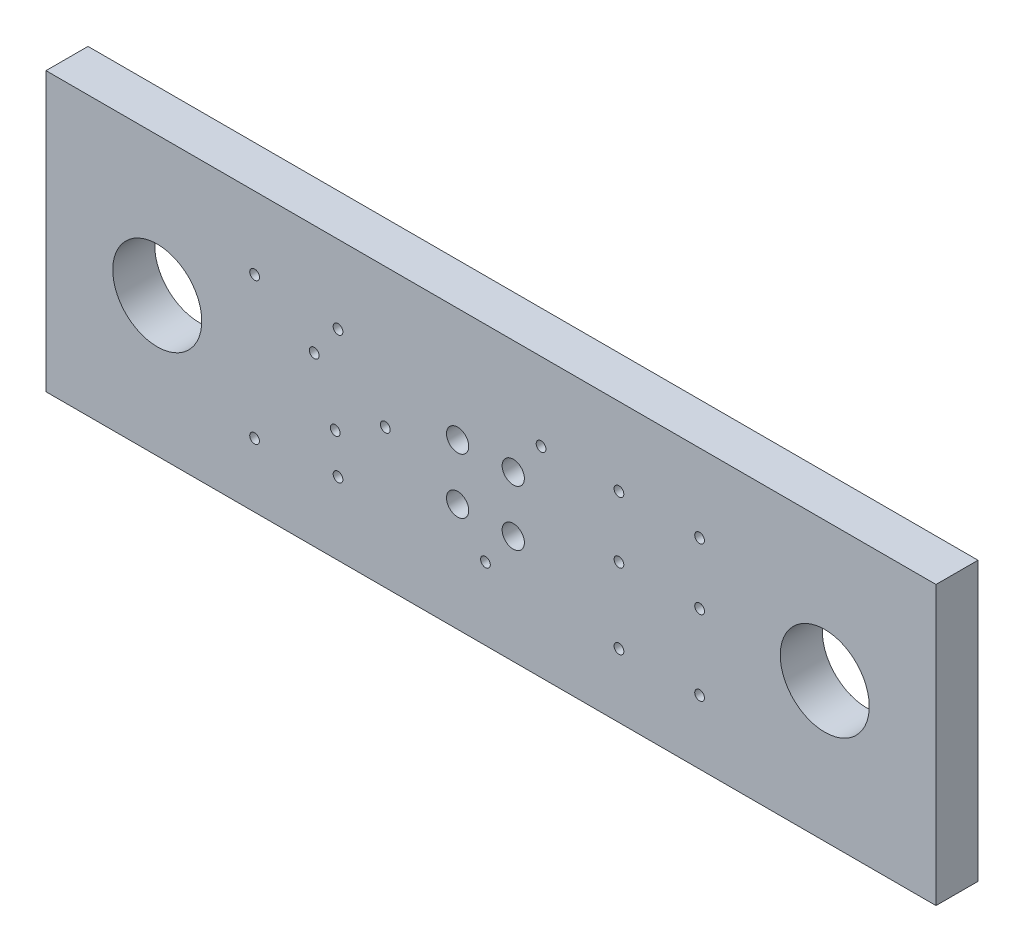
ISO-10303-21;
HEADER;
FILE_DESCRIPTION(('STEP AP214'),'2;1');
FILE_NAME('part.step','',(''),(''),'','','');
FILE_SCHEMA(('AUTOMOTIVE_DESIGN { 1 0 10303 214 1 1 1 1 }'));
ENDSEC;
DATA;
#1=APPLICATION_CONTEXT('core data for automotive mechanical design processes');
#2=APPLICATION_PROTOCOL_DEFINITION('international standard','automotive_design',2000,#1);
#3=PRODUCT_CONTEXT('',#1,'mechanical');
#4=PRODUCT('Part','Part','',(#3));
#5=PRODUCT_RELATED_PRODUCT_CATEGORY('part','',(#4));
#6=PRODUCT_DEFINITION_FORMATION('','',#4);
#7=PRODUCT_DEFINITION_CONTEXT('part definition',#1,'design');
#8=PRODUCT_DEFINITION('design','',#6,#7);
#9=PRODUCT_DEFINITION_SHAPE('','',#8);
#10=(LENGTH_UNIT() NAMED_UNIT(*) SI_UNIT(.MILLI.,.METRE.));
#11=(NAMED_UNIT(*) PLANE_ANGLE_UNIT() SI_UNIT($,.RADIAN.));
#12=(NAMED_UNIT(*) SI_UNIT($,.STERADIAN.) SOLID_ANGLE_UNIT());
#13=UNCERTAINTY_MEASURE_WITH_UNIT(LENGTH_MEASURE(1.E-05),#10,'distance_accuracy_value','');
#14=(GEOMETRIC_REPRESENTATION_CONTEXT(3) GLOBAL_UNCERTAINTY_ASSIGNED_CONTEXT((#13)) GLOBAL_UNIT_ASSIGNED_CONTEXT((#10,
#11,#12)) REPRESENTATION_CONTEXT('',''));
#15=CARTESIAN_POINT('',(0.,0.,0.));
#16=DIRECTION('',(0.,0.,1.));
#17=DIRECTION('',(1.,0.,0.));
#18=AXIS2_PLACEMENT_3D('',#15,#16,#17);
#19=CARTESIAN_POINT('',(147.5,-109.8,-0.036));
#20=DIRECTION('',(0.,0.,-1.));
#21=DIRECTION('',(0.,-1.,0.));
#22=AXIS2_PLACEMENT_3D('',#19,#20,#21);
#23=CYLINDRICAL_SURFACE('',#22,0.175);
#24=CARTESIAN_POINT('',(147.5,-109.8,0.));
#25=DIRECTION('',(0.,0.,-1.));
#26=DIRECTION('',(0.,-1.,0.));
#27=AXIS2_PLACEMENT_3D('',#24,#25,#26);
#28=CIRCLE('',#27,0.175);
#29=CARTESIAN_POINT('',(147.5,-109.975,0.));
#30=VERTEX_POINT('',#29);
#31=EDGE_CURVE('E218',#30,#30,#28,.T.);
#32=ORIENTED_EDGE('',*,*,#31,.T.);
#33=DIRECTION('',(0.,0.,1.));
#34=VECTOR('',#33,1.);
#35=CARTESIAN_POINT('',(147.5,-109.975,-0.036));
#36=LINE('',#35,#34);
#37=CARTESIAN_POINT('',(147.5,-109.975,1.51));
#38=VERTEX_POINT('',#37);
#39=EDGE_CURVE('E11',#30,#38,#36,.T.);
#40=ORIENTED_EDGE('',*,*,#39,.T.);
#41=CARTESIAN_POINT('',(147.5,-109.8,1.51));
#42=DIRECTION('',(0.,0.,-1.));
#43=DIRECTION('',(0.,-1.,0.));
#44=AXIS2_PLACEMENT_3D('',#41,#42,#43);
#45=CIRCLE('',#44,0.175);
#46=EDGE_CURVE('E283',#38,#38,#45,.T.);
#47=ORIENTED_EDGE('',*,*,#46,.F.);
#48=ORIENTED_EDGE('',*,*,#39,.F.);
#49=EDGE_LOOP('',(#32,#40,#47,#48));
#50=FACE_BOUND('',#49,.T.);
#51=ADVANCED_FACE('F16',(#50),#23,.F.);
#52=CARTESIAN_POINT('',(144.6,-109.8,-0.036));
#53=DIRECTION('',(0.,0.,-1.));
#54=DIRECTION('',(-1.624097681738E-13,-1.,0.));
#55=AXIS2_PLACEMENT_3D('',#52,#53,#54);
#56=CYLINDRICAL_SURFACE('',#55,0.175);
#57=CARTESIAN_POINT('',(144.6,-109.8,0.));
#58=DIRECTION('',(0.,0.,-1.));
#59=DIRECTION('',(-1.624097681738E-13,-1.,0.));
#60=AXIS2_PLACEMENT_3D('',#57,#58,#59);
#61=CIRCLE('',#60,0.175);
#62=CARTESIAN_POINT('',(144.6,-109.975,0.));
#63=VERTEX_POINT('',#62);
#64=EDGE_CURVE('E339',#63,#63,#61,.T.);
#65=ORIENTED_EDGE('',*,*,#64,.T.);
#66=DIRECTION('',(0.,0.,1.));
#67=VECTOR('',#66,1.);
#68=CARTESIAN_POINT('',(144.6,-109.975,-0.036));
#69=LINE('',#68,#67);
#70=CARTESIAN_POINT('',(144.6,-109.975,1.51));
#71=VERTEX_POINT('',#70);
#72=EDGE_CURVE('E27',#63,#71,#69,.T.);
#73=ORIENTED_EDGE('',*,*,#72,.T.);
#74=CARTESIAN_POINT('',(144.6,-109.8,1.51));
#75=DIRECTION('',(0.,0.,-1.));
#76=DIRECTION('',(-1.624097681738E-13,-1.,0.));
#77=AXIS2_PLACEMENT_3D('',#74,#75,#76);
#78=CIRCLE('',#77,0.175);
#79=EDGE_CURVE('E263',#71,#71,#78,.T.);
#80=ORIENTED_EDGE('',*,*,#79,.F.);
#81=ORIENTED_EDGE('',*,*,#72,.F.);
#82=EDGE_LOOP('',(#65,#73,#80,#81));
#83=FACE_BOUND('',#82,.T.);
#84=ADVANCED_FACE('F576',(#83),#56,.F.);
#85=CARTESIAN_POINT('',(141.8,-109.8,-0.036));
#86=DIRECTION('',(0.,0.,-1.));
#87=DIRECTION('',(0.,-1.,0.));
#88=AXIS2_PLACEMENT_3D('',#85,#86,#87);
#89=CYLINDRICAL_SURFACE('',#88,0.175);
#90=CARTESIAN_POINT('',(141.8,-109.8,0.));
#91=DIRECTION('',(0.,0.,-1.));
#92=DIRECTION('',(0.,-1.,0.));
#93=AXIS2_PLACEMENT_3D('',#90,#91,#92);
#94=CIRCLE('',#93,0.175);
#95=CARTESIAN_POINT('',(141.8,-109.975,0.));
#96=VERTEX_POINT('',#95);
#97=EDGE_CURVE('E343',#96,#96,#94,.T.);
#98=ORIENTED_EDGE('',*,*,#97,.T.);
#99=DIRECTION('',(0.,0.,1.));
#100=VECTOR('',#99,1.);
#101=CARTESIAN_POINT('',(141.8,-109.975,-0.036));
#102=LINE('',#101,#100);
#103=CARTESIAN_POINT('',(141.8,-109.975,1.51));
#104=VERTEX_POINT('',#103);
#105=EDGE_CURVE('E286',#96,#104,#102,.T.);
#106=ORIENTED_EDGE('',*,*,#105,.T.);
#107=CARTESIAN_POINT('',(141.8,-109.8,1.51));
#108=DIRECTION('',(0.,0.,-1.));
#109=DIRECTION('',(0.,-1.,0.));
#110=AXIS2_PLACEMENT_3D('',#107,#108,#109);
#111=CIRCLE('',#110,0.175);
#112=EDGE_CURVE('E254',#104,#104,#111,.T.);
#113=ORIENTED_EDGE('',*,*,#112,.F.);
#114=ORIENTED_EDGE('',*,*,#105,.F.);
#115=EDGE_LOOP('',(#98,#106,#113,#114));
#116=FACE_BOUND('',#115,.T.);
#117=ADVANCED_FACE('F581',(#116),#89,.F.);
#118=CARTESIAN_POINT('',(152.,-112.,-0.046));
#119=DIRECTION('',(0.,0.,-1.));
#120=DIRECTION('',(0.,-1.,0.));
#121=AXIS2_PLACEMENT_3D('',#118,#119,#120);
#122=CYLINDRICAL_SURFACE('',#121,1.6);
#123=CARTESIAN_POINT('',(152.,-112.,0.));
#124=DIRECTION('',(0.,0.,-1.));
#125=DIRECTION('',(0.,-1.,0.));
#126=AXIS2_PLACEMENT_3D('',#123,#124,#125);
#127=CIRCLE('',#126,1.6);
#128=CARTESIAN_POINT('',(152.,-113.6,0.));
#129=VERTEX_POINT('',#128);
#130=EDGE_CURVE('E350',#129,#129,#127,.T.);
#131=ORIENTED_EDGE('',*,*,#130,.T.);
#132=DIRECTION('',(0.,0.,1.));
#133=VECTOR('',#132,1.);
#134=CARTESIAN_POINT('',(152.,-113.6,-0.046));
#135=LINE('',#134,#133);
#136=CARTESIAN_POINT('',(152.,-113.6,1.51));
#137=VERTEX_POINT('',#136);
#138=EDGE_CURVE('E405',#129,#137,#135,.T.);
#139=ORIENTED_EDGE('',*,*,#138,.T.);
#140=CARTESIAN_POINT('',(152.,-112.,1.51));
#141=DIRECTION('',(0.,0.,-1.));
#142=DIRECTION('',(0.,-1.,0.));
#143=AXIS2_PLACEMENT_3D('',#140,#141,#142);
#144=CIRCLE('',#143,1.6);
#145=EDGE_CURVE('E251',#137,#137,#144,.T.);
#146=ORIENTED_EDGE('',*,*,#145,.F.);
#147=ORIENTED_EDGE('',*,*,#138,.F.);
#148=EDGE_LOOP('',(#131,#139,#146,#147));
#149=FACE_BOUND('',#148,.T.);
#150=ADVANCED_FACE('F591',(#149),#122,.F.);
#151=CARTESIAN_POINT('',(147.5,-112.,-0.036));
#152=DIRECTION('',(0.,0.,-1.));
#153=DIRECTION('',(0.,-1.,0.));
#154=AXIS2_PLACEMENT_3D('',#151,#152,#153);
#155=CYLINDRICAL_SURFACE('',#154,0.175);
#156=CARTESIAN_POINT('',(147.5,-112.,0.));
#157=DIRECTION('',(0.,0.,-1.));
#158=DIRECTION('',(0.,-1.,0.));
#159=AXIS2_PLACEMENT_3D('',#156,#157,#158);
#160=CIRCLE('',#159,0.175);
#161=CARTESIAN_POINT('',(147.5,-112.175,0.));
#162=VERTEX_POINT('',#161);
#163=EDGE_CURVE('E361',#162,#162,#160,.T.);
#164=ORIENTED_EDGE('',*,*,#163,.T.);
#165=DIRECTION('',(0.,0.,1.));
#166=VECTOR('',#165,1.);
#167=CARTESIAN_POINT('',(147.5,-112.175,-0.036));
#168=LINE('',#167,#166);
#169=CARTESIAN_POINT('',(147.5,-112.175,1.51));
#170=VERTEX_POINT('',#169);
#171=EDGE_CURVE('E460',#162,#170,#168,.T.);
#172=ORIENTED_EDGE('',*,*,#171,.T.);
#173=CARTESIAN_POINT('',(147.5,-112.,1.51));
#174=DIRECTION('',(0.,0.,-1.));
#175=DIRECTION('',(0.,-1.,0.));
#176=AXIS2_PLACEMENT_3D('',#173,#174,#175);
#177=CIRCLE('',#176,0.175);
#178=EDGE_CURVE('E255',#170,#170,#177,.T.);
#179=ORIENTED_EDGE('',*,*,#178,.F.);
#180=ORIENTED_EDGE('',*,*,#171,.F.);
#181=EDGE_LOOP('',(#164,#172,#179,#180));
#182=FACE_BOUND('',#181,.T.);
#183=ADVANCED_FACE('F587',(#182),#155,.F.);
#184=CARTESIAN_POINT('',(140.8,-111.1,-0.046));
#185=DIRECTION('',(0.,0.,-1.));
#186=DIRECTION('',(0.,-1.,0.));
#187=AXIS2_PLACEMENT_3D('',#184,#185,#186);
#188=CYLINDRICAL_SURFACE('',#187,0.4);
#189=CARTESIAN_POINT('',(140.8,-111.1,0.));
#190=DIRECTION('',(0.,0.,-1.));
#191=DIRECTION('',(0.,-1.,0.));
#192=AXIS2_PLACEMENT_3D('',#189,#190,#191);
#193=CIRCLE('',#192,0.4);
#194=CARTESIAN_POINT('',(140.8,-111.5,0.));
#195=VERTEX_POINT('',#194);
#196=EDGE_CURVE('E357',#195,#195,#193,.T.);
#197=ORIENTED_EDGE('',*,*,#196,.T.);
#198=DIRECTION('',(0.,0.,1.));
#199=VECTOR('',#198,1.);
#200=CARTESIAN_POINT('',(140.8,-111.5,-0.046));
#201=LINE('',#200,#199);
#202=CARTESIAN_POINT('',(140.8,-111.5,1.51));
#203=VERTEX_POINT('',#202);
#204=EDGE_CURVE('E290',#195,#203,#201,.T.);
#205=ORIENTED_EDGE('',*,*,#204,.T.);
#206=CARTESIAN_POINT('',(140.8,-111.1,1.51));
#207=DIRECTION('',(0.,0.,-1.));
#208=DIRECTION('',(0.,-1.,0.));
#209=AXIS2_PLACEMENT_3D('',#206,#207,#208);
#210=CIRCLE('',#209,0.4);
#211=EDGE_CURVE('E266',#203,#203,#210,.T.);
#212=ORIENTED_EDGE('',*,*,#211,.F.);
#213=ORIENTED_EDGE('',*,*,#204,.F.);
#214=EDGE_LOOP('',(#197,#205,#212,#213));
#215=FACE_BOUND('',#214,.T.);
#216=ADVANCED_FACE('F590',(#215),#188,.F.);
#217=CARTESIAN_POINT('',(144.6,-112.,-0.036));
#218=DIRECTION('',(0.,0.,-1.));
#219=DIRECTION('',(-1.624097681738E-13,-1.,0.));
#220=AXIS2_PLACEMENT_3D('',#217,#218,#219);
#221=CYLINDRICAL_SURFACE('',#220,0.175);
#222=CARTESIAN_POINT('',(144.6,-112.,0.));
#223=DIRECTION('',(0.,0.,-1.));
#224=DIRECTION('',(-1.624097681738E-13,-1.,0.));
#225=AXIS2_PLACEMENT_3D('',#222,#223,#224);
#226=CIRCLE('',#225,0.175);
#227=CARTESIAN_POINT('',(144.6,-112.175,0.));
#228=VERTEX_POINT('',#227);
#229=EDGE_CURVE('E362',#228,#228,#226,.T.);
#230=ORIENTED_EDGE('',*,*,#229,.T.);
#231=DIRECTION('',(0.,0.,1.));
#232=VECTOR('',#231,1.);
#233=CARTESIAN_POINT('',(144.6,-112.175,-0.036));
#234=LINE('',#233,#232);
#235=CARTESIAN_POINT('',(144.6,-112.175,1.51));
#236=VERTEX_POINT('',#235);
#237=EDGE_CURVE('E287',#228,#236,#234,.T.);
#238=ORIENTED_EDGE('',*,*,#237,.T.);
#239=CARTESIAN_POINT('',(144.6,-112.,1.51));
#240=DIRECTION('',(0.,0.,-1.));
#241=DIRECTION('',(-1.624097681738E-13,-1.,0.));
#242=AXIS2_PLACEMENT_3D('',#239,#240,#241);
#243=CIRCLE('',#242,0.175);
#244=EDGE_CURVE('E274',#236,#236,#243,.T.);
#245=ORIENTED_EDGE('',*,*,#244,.F.);
#246=ORIENTED_EDGE('',*,*,#237,.F.);
#247=EDGE_LOOP('',(#230,#238,#245,#246));
#248=FACE_BOUND('',#247,.T.);
#249=ADVANCED_FACE('F596',(#248),#221,.F.);
#250=CARTESIAN_POINT('',(134.5,-109.8,-0.036));
#251=DIRECTION('',(0.,0.,-1.));
#252=DIRECTION('',(0.,-1.,0.));
#253=AXIS2_PLACEMENT_3D('',#250,#251,#252);
#254=CYLINDRICAL_SURFACE('',#253,0.175);
#255=CARTESIAN_POINT('',(134.5,-109.8,0.));
#256=DIRECTION('',(0.,0.,-1.));
#257=DIRECTION('',(0.,-1.,0.));
#258=AXIS2_PLACEMENT_3D('',#255,#256,#257);
#259=CIRCLE('',#258,0.175);
#260=CARTESIAN_POINT('',(134.5,-109.975,0.));
#261=VERTEX_POINT('',#260);
#262=EDGE_CURVE('E399',#261,#261,#259,.T.);
#263=ORIENTED_EDGE('',*,*,#262,.T.);
#264=DIRECTION('',(0.,0.,1.));
#265=VECTOR('',#264,1.);
#266=CARTESIAN_POINT('',(134.5,-109.975,-0.036));
#267=LINE('',#266,#265);
#268=CARTESIAN_POINT('',(134.5,-109.975,1.51));
#269=VERTEX_POINT('',#268);
#270=EDGE_CURVE('E291',#261,#269,#267,.T.);
#271=ORIENTED_EDGE('',*,*,#270,.T.);
#272=CARTESIAN_POINT('',(134.5,-109.8,1.51));
#273=DIRECTION('',(0.,0.,-1.));
#274=DIRECTION('',(0.,-1.,0.));
#275=AXIS2_PLACEMENT_3D('',#272,#273,#274);
#276=CIRCLE('',#275,0.175);
#277=EDGE_CURVE('E328',#269,#269,#276,.T.);
#278=ORIENTED_EDGE('',*,*,#277,.F.);
#279=ORIENTED_EDGE('',*,*,#270,.F.);
#280=EDGE_LOOP('',(#263,#271,#278,#279));
#281=FACE_BOUND('',#280,.T.);
#282=ADVANCED_FACE('F499',(#281),#254,.F.);
#283=CARTESIAN_POINT('',(131.5,-109.6,-0.036));
#284=DIRECTION('',(0.,0.,-1.));
#285=DIRECTION('',(0.,-1.,0.));
#286=AXIS2_PLACEMENT_3D('',#283,#284,#285);
#287=CYLINDRICAL_SURFACE('',#286,0.175);
#288=CARTESIAN_POINT('',(131.5,-109.6,0.));
#289=DIRECTION('',(0.,0.,-1.));
#290=DIRECTION('',(0.,-1.,0.));
#291=AXIS2_PLACEMENT_3D('',#288,#289,#290);
#292=CIRCLE('',#291,0.175);
#293=CARTESIAN_POINT('',(131.5,-109.775,0.));
#294=VERTEX_POINT('',#293);
#295=EDGE_CURVE('E395',#294,#294,#292,.T.);
#296=ORIENTED_EDGE('',*,*,#295,.T.);
#297=DIRECTION('',(0.,0.,1.));
#298=VECTOR('',#297,1.);
#299=CARTESIAN_POINT('',(131.5,-109.775,-0.036));
#300=LINE('',#299,#298);
#301=CARTESIAN_POINT('',(131.5,-109.775,1.51));
#302=VERTEX_POINT('',#301);
#303=EDGE_CURVE('E423',#294,#302,#300,.T.);
#304=ORIENTED_EDGE('',*,*,#303,.T.);
#305=CARTESIAN_POINT('',(131.5,-109.6,1.51));
#306=DIRECTION('',(0.,0.,-1.));
#307=DIRECTION('',(0.,-1.,0.));
#308=AXIS2_PLACEMENT_3D('',#305,#306,#307);
#309=CIRCLE('',#308,0.175);
#310=EDGE_CURVE('E319',#302,#302,#309,.T.);
#311=ORIENTED_EDGE('',*,*,#310,.F.);
#312=ORIENTED_EDGE('',*,*,#303,.F.);
#313=EDGE_LOOP('',(#296,#304,#311,#312));
#314=FACE_BOUND('',#313,.T.);
#315=ADVANCED_FACE('F609',(#314),#287,.F.);
#316=CARTESIAN_POINT('',(138.8,-111.1,-0.046));
#317=DIRECTION('',(0.,0.,-1.));
#318=DIRECTION('',(0.,-1.,0.));
#319=AXIS2_PLACEMENT_3D('',#316,#317,#318);
#320=CYLINDRICAL_SURFACE('',#319,0.4);
#321=CARTESIAN_POINT('',(138.8,-111.1,0.));
#322=DIRECTION('',(0.,0.,-1.));
#323=DIRECTION('',(0.,-1.,0.));
#324=AXIS2_PLACEMENT_3D('',#321,#322,#323);
#325=CIRCLE('',#324,0.4);
#326=CARTESIAN_POINT('',(138.8,-111.5,0.));
#327=VERTEX_POINT('',#326);
#328=EDGE_CURVE('E391',#327,#327,#325,.T.);
#329=ORIENTED_EDGE('',*,*,#328,.T.);
#330=DIRECTION('',(0.,0.,1.));
#331=VECTOR('',#330,1.);
#332=CARTESIAN_POINT('',(138.8,-111.5,-0.046));
#333=LINE('',#332,#331);
#334=CARTESIAN_POINT('',(138.8,-111.5,1.51));
#335=VERTEX_POINT('',#334);
#336=EDGE_CURVE('E414',#327,#335,#333,.T.);
#337=ORIENTED_EDGE('',*,*,#336,.T.);
#338=CARTESIAN_POINT('',(138.8,-111.1,1.51));
#339=DIRECTION('',(0.,0.,-1.));
#340=DIRECTION('',(0.,-1.,0.));
#341=AXIS2_PLACEMENT_3D('',#338,#339,#340);
#342=CIRCLE('',#341,0.4);
#343=EDGE_CURVE('E315',#335,#335,#342,.T.);
#344=ORIENTED_EDGE('',*,*,#343,.F.);
#345=ORIENTED_EDGE('',*,*,#336,.F.);
#346=EDGE_LOOP('',(#329,#337,#344,#345));
#347=FACE_BOUND('',#346,.T.);
#348=ADVANCED_FACE('F613',(#347),#320,.F.);
#349=CARTESIAN_POINT('',(133.642998,-110.968451,-0.036));
#350=DIRECTION('',(0.,0.,-1.));
#351=DIRECTION('',(1.624097681737E-13,-1.,0.));
#352=AXIS2_PLACEMENT_3D('',#349,#350,#351);
#353=CYLINDRICAL_SURFACE('',#352,0.175);
#354=CARTESIAN_POINT('',(133.642998,-110.968451,0.));
#355=DIRECTION('',(0.,0.,-1.));
#356=DIRECTION('',(1.624097681737E-13,-1.,0.));
#357=AXIS2_PLACEMENT_3D('',#354,#355,#356);
#358=CIRCLE('',#357,0.175);
#359=CARTESIAN_POINT('',(133.642998,-111.143451,0.));
#360=VERTEX_POINT('',#359);
#361=EDGE_CURVE('E370',#360,#360,#358,.T.);
#362=ORIENTED_EDGE('',*,*,#361,.T.);
#363=DIRECTION('',(0.,0.,1.));
#364=VECTOR('',#363,1.);
#365=CARTESIAN_POINT('',(133.642998,-111.143451,-0.036));
#366=LINE('',#365,#364);
#367=CARTESIAN_POINT('',(133.642998,-111.143451,1.51));
#368=VERTEX_POINT('',#367);
#369=EDGE_CURVE('E411',#360,#368,#366,.T.);
#370=ORIENTED_EDGE('',*,*,#369,.T.);
#371=CARTESIAN_POINT('',(133.642998,-110.968451,1.51));
#372=DIRECTION('',(0.,0.,-1.));
#373=DIRECTION('',(1.624097681737E-13,-1.,0.));
#374=AXIS2_PLACEMENT_3D('',#371,#372,#373);
#375=CIRCLE('',#374,0.175);
#376=EDGE_CURVE('E313',#368,#368,#375,.T.);
#377=ORIENTED_EDGE('',*,*,#376,.F.);
#378=ORIENTED_EDGE('',*,*,#369,.F.);
#379=EDGE_LOOP('',(#362,#370,#377,#378));
#380=FACE_BOUND('',#379,.T.);
#381=ADVANCED_FACE('F619',(#380),#353,.F.);
#382=CARTESIAN_POINT('',(136.2,-112.,-0.036));
#383=DIRECTION('',(0.,0.,-1.));
#384=DIRECTION('',(0.,-1.,0.));
#385=AXIS2_PLACEMENT_3D('',#382,#383,#384);
#386=CYLINDRICAL_SURFACE('',#385,0.175);
#387=CARTESIAN_POINT('',(136.2,-112.,0.));
#388=DIRECTION('',(0.,0.,-1.));
#389=DIRECTION('',(0.,-1.,0.));
#390=AXIS2_PLACEMENT_3D('',#387,#388,#389);
#391=CIRCLE('',#390,0.175);
#392=CARTESIAN_POINT('',(136.2,-112.175,0.));
#393=VERTEX_POINT('',#392);
#394=EDGE_CURVE('E366',#393,#393,#391,.T.);
#395=ORIENTED_EDGE('',*,*,#394,.T.);
#396=DIRECTION('',(0.,0.,1.));
#397=VECTOR('',#396,1.);
#398=CARTESIAN_POINT('',(136.2,-112.175,-0.036));
#399=LINE('',#398,#397);
#400=CARTESIAN_POINT('',(136.2,-112.175,1.51));
#401=VERTEX_POINT('',#400);
#402=EDGE_CURVE('E383',#393,#401,#399,.T.);
#403=ORIENTED_EDGE('',*,*,#402,.T.);
#404=CARTESIAN_POINT('',(136.2,-112.,1.51));
#405=DIRECTION('',(0.,0.,-1.));
#406=DIRECTION('',(0.,-1.,0.));
#407=AXIS2_PLACEMENT_3D('',#404,#405,#406);
#408=CIRCLE('',#407,0.175);
#409=EDGE_CURVE('E309',#401,#401,#408,.T.);
#410=ORIENTED_EDGE('',*,*,#409,.F.);
#411=ORIENTED_EDGE('',*,*,#402,.F.);
#412=EDGE_LOOP('',(#395,#403,#410,#411));
#413=FACE_BOUND('',#412,.T.);
#414=ADVANCED_FACE('F625',(#413),#386,.F.);
#415=CARTESIAN_POINT('',(128.,-112.,-0.046));
#416=DIRECTION('',(0.,0.,-1.));
#417=DIRECTION('',(0.,-1.,0.));
#418=AXIS2_PLACEMENT_3D('',#415,#416,#417);
#419=CYLINDRICAL_SURFACE('',#418,1.6);
#420=CARTESIAN_POINT('',(128.,-112.,0.));
#421=DIRECTION('',(0.,0.,-1.));
#422=DIRECTION('',(0.,-1.,0.));
#423=AXIS2_PLACEMENT_3D('',#420,#421,#422);
#424=CIRCLE('',#423,1.6);
#425=CARTESIAN_POINT('',(128.,-113.6,0.));
#426=VERTEX_POINT('',#425);
#427=EDGE_CURVE('E371',#426,#426,#424,.T.);
#428=ORIENTED_EDGE('',*,*,#427,.T.);
#429=DIRECTION('',(0.,0.,1.));
#430=VECTOR('',#429,1.);
#431=CARTESIAN_POINT('',(128.,-113.6,-0.046));
#432=LINE('',#431,#430);
#433=CARTESIAN_POINT('',(128.,-113.6,1.51));
#434=VERTEX_POINT('',#433);
#435=EDGE_CURVE('E302',#426,#434,#432,.T.);
#436=ORIENTED_EDGE('',*,*,#435,.T.);
#437=CARTESIAN_POINT('',(128.,-112.,1.51));
#438=DIRECTION('',(0.,0.,-1.));
#439=DIRECTION('',(0.,-1.,0.));
#440=AXIS2_PLACEMENT_3D('',#437,#438,#439);
#441=CIRCLE('',#440,1.6);
#442=EDGE_CURVE('E314',#434,#434,#441,.T.);
#443=ORIENTED_EDGE('',*,*,#442,.F.);
#444=ORIENTED_EDGE('',*,*,#435,.F.);
#445=EDGE_LOOP('',(#428,#436,#443,#444));
#446=FACE_BOUND('',#445,.T.);
#447=ADVANCED_FACE('F628',(#446),#419,.F.);
#448=CARTESIAN_POINT('',(140.8,-113.1,-0.046));
#449=DIRECTION('',(0.,0.,-1.));
#450=DIRECTION('',(0.,-1.,0.));
#451=AXIS2_PLACEMENT_3D('',#448,#449,#450);
#452=CYLINDRICAL_SURFACE('',#451,0.4);
#453=CARTESIAN_POINT('',(140.8,-113.1,0.));
#454=DIRECTION('',(0.,0.,-1.));
#455=DIRECTION('',(0.,-1.,0.));
#456=AXIS2_PLACEMENT_3D('',#453,#454,#455);
#457=CIRCLE('',#456,0.4);
#458=CARTESIAN_POINT('',(140.8,-113.5,0.));
#459=VERTEX_POINT('',#458);
#460=EDGE_CURVE('E424',#459,#459,#457,.T.);
#461=ORIENTED_EDGE('',*,*,#460,.T.);
#462=DIRECTION('',(0.,0.,1.));
#463=VECTOR('',#462,1.);
#464=CARTESIAN_POINT('',(140.8,-113.5,-0.046));
#465=LINE('',#464,#463);
#466=CARTESIAN_POINT('',(140.8,-113.5,1.51));
#467=VERTEX_POINT('',#466);
#468=EDGE_CURVE('E249',#459,#467,#465,.T.);
#469=ORIENTED_EDGE('',*,*,#468,.T.);
#470=CARTESIAN_POINT('',(140.8,-113.1,1.51));
#471=DIRECTION('',(0.,0.,-1.));
#472=DIRECTION('',(0.,-1.,0.));
#473=AXIS2_PLACEMENT_3D('',#470,#471,#472);
#474=CIRCLE('',#473,0.4);
#475=EDGE_CURVE('E432',#467,#467,#474,.T.);
#476=ORIENTED_EDGE('',*,*,#475,.F.);
#477=ORIENTED_EDGE('',*,*,#468,.F.);
#478=EDGE_LOOP('',(#461,#469,#476,#477));
#479=FACE_BOUND('',#478,.T.);
#480=ADVANCED_FACE('F604',(#479),#452,.F.);
#481=CARTESIAN_POINT('',(147.5,-114.7,-0.036));
#482=DIRECTION('',(0.,0.,-1.));
#483=DIRECTION('',(0.,-1.,0.));
#484=AXIS2_PLACEMENT_3D('',#481,#482,#483);
#485=CYLINDRICAL_SURFACE('',#484,0.175);
#486=CARTESIAN_POINT('',(147.5,-114.7,0.));
#487=DIRECTION('',(0.,0.,-1.));
#488=DIRECTION('',(0.,-1.,0.));
#489=AXIS2_PLACEMENT_3D('',#486,#487,#488);
#490=CIRCLE('',#489,0.175);
#491=CARTESIAN_POINT('',(147.5,-114.875,0.));
#492=VERTEX_POINT('',#491);
#493=EDGE_CURVE('E20',#492,#492,#490,.T.);
#494=ORIENTED_EDGE('',*,*,#493,.T.);
#495=DIRECTION('',(0.,0.,1.));
#496=VECTOR('',#495,1.);
#497=CARTESIAN_POINT('',(147.5,-114.875,-0.036));
#498=LINE('',#497,#496);
#499=CARTESIAN_POINT('',(147.5,-114.875,1.51));
#500=VERTEX_POINT('',#499);
#501=EDGE_CURVE('E246',#492,#500,#498,.T.);
#502=ORIENTED_EDGE('',*,*,#501,.T.);
#503=CARTESIAN_POINT('',(147.5,-114.7,1.51));
#504=DIRECTION('',(0.,0.,-1.));
#505=DIRECTION('',(0.,-1.,0.));
#506=AXIS2_PLACEMENT_3D('',#503,#504,#505);
#507=CIRCLE('',#506,0.175);
#508=EDGE_CURVE('E438',#500,#500,#507,.T.);
#509=ORIENTED_EDGE('',*,*,#508,.F.);
#510=ORIENTED_EDGE('',*,*,#501,.F.);
#511=EDGE_LOOP('',(#494,#502,#509,#510));
#512=FACE_BOUND('',#511,.T.);
#513=ADVANCED_FACE('F600',(#512),#485,.F.);
#514=CARTESIAN_POINT('',(144.6,-114.7,-0.036));
#515=DIRECTION('',(0.,0.,-1.));
#516=DIRECTION('',(-1.624097681738E-13,-1.,0.));
#517=AXIS2_PLACEMENT_3D('',#514,#515,#516);
#518=CYLINDRICAL_SURFACE('',#517,0.175);
#519=CARTESIAN_POINT('',(144.6,-114.7,0.));
#520=DIRECTION('',(0.,0.,-1.));
#521=DIRECTION('',(-1.624097681738E-13,-1.,0.));
#522=AXIS2_PLACEMENT_3D('',#519,#520,#521);
#523=CIRCLE('',#522,0.175);
#524=CARTESIAN_POINT('',(144.6,-114.875,0.));
#525=VERTEX_POINT('',#524);
#526=EDGE_CURVE('E334',#525,#525,#523,.T.);
#527=ORIENTED_EDGE('',*,*,#526,.T.);
#528=DIRECTION('',(0.,0.,1.));
#529=VECTOR('',#528,1.);
#530=CARTESIAN_POINT('',(144.6,-114.875,-0.036));
#531=LINE('',#530,#529);
#532=CARTESIAN_POINT('',(144.6,-114.875,1.51));
#533=VERTEX_POINT('',#532);
#534=EDGE_CURVE('E250',#525,#533,#531,.T.);
#535=ORIENTED_EDGE('',*,*,#534,.T.);
#536=CARTESIAN_POINT('',(144.6,-114.7,1.51));
#537=DIRECTION('',(0.,0.,-1.));
#538=DIRECTION('',(-1.624097681738E-13,-1.,0.));
#539=AXIS2_PLACEMENT_3D('',#536,#537,#538);
#540=CIRCLE('',#539,0.175);
#541=EDGE_CURVE('E434',#533,#533,#540,.T.);
#542=ORIENTED_EDGE('',*,*,#541,.F.);
#543=ORIENTED_EDGE('',*,*,#534,.F.);
#544=EDGE_LOOP('',(#527,#535,#542,#543));
#545=FACE_BOUND('',#544,.T.);
#546=ADVANCED_FACE('F603',(#545),#518,.F.);
#547=CARTESIAN_POINT('',(138.8,-113.1,-0.046));
#548=DIRECTION('',(0.,0.,-1.));
#549=DIRECTION('',(0.,-1.,0.));
#550=AXIS2_PLACEMENT_3D('',#547,#548,#549);
#551=CYLINDRICAL_SURFACE('',#550,0.4);
#552=CARTESIAN_POINT('',(138.8,-113.1,0.));
#553=DIRECTION('',(0.,0.,-1.));
#554=DIRECTION('',(0.,-1.,0.));
#555=AXIS2_PLACEMENT_3D('',#552,#553,#554);
#556=CIRCLE('',#555,0.4);
#557=CARTESIAN_POINT('',(138.8,-113.5,0.));
#558=VERTEX_POINT('',#557);
#559=EDGE_CURVE('E338',#558,#558,#556,.T.);
#560=ORIENTED_EDGE('',*,*,#559,.T.);
#561=DIRECTION('',(0.,0.,1.));
#562=VECTOR('',#561,1.);
#563=CARTESIAN_POINT('',(138.8,-113.5,-0.046));
#564=LINE('',#563,#562);
#565=CARTESIAN_POINT('',(138.8,-113.5,1.51));
#566=VERTEX_POINT('',#565);
#567=EDGE_CURVE('E372',#558,#566,#564,.T.);
#568=ORIENTED_EDGE('',*,*,#567,.T.);
#569=CARTESIAN_POINT('',(138.8,-113.1,1.51));
#570=DIRECTION('',(0.,0.,-1.));
#571=DIRECTION('',(0.,-1.,0.));
#572=AXIS2_PLACEMENT_3D('',#569,#570,#571);
#573=CIRCLE('',#572,0.4);
#574=EDGE_CURVE('E278',#566,#566,#573,.T.);
#575=ORIENTED_EDGE('',*,*,#574,.F.);
#576=ORIENTED_EDGE('',*,*,#567,.F.);
#577=EDGE_LOOP('',(#560,#568,#575,#576));
#578=FACE_BOUND('',#577,.T.);
#579=ADVANCED_FACE('F585',(#578),#551,.F.);
#580=CARTESIAN_POINT('',(134.4,-113.,-0.036));
#581=DIRECTION('',(0.,0.,-1.));
#582=DIRECTION('',(1.624097681737E-13,-1.,0.));
#583=AXIS2_PLACEMENT_3D('',#580,#581,#582);
#584=CYLINDRICAL_SURFACE('',#583,0.175);
#585=CARTESIAN_POINT('',(134.4,-113.,0.));
#586=DIRECTION('',(0.,0.,-1.));
#587=DIRECTION('',(1.624097681737E-13,-1.,0.));
#588=AXIS2_PLACEMENT_3D('',#585,#586,#587);
#589=CIRCLE('',#588,0.175);
#590=CARTESIAN_POINT('',(134.4,-113.175,0.));
#591=VERTEX_POINT('',#590);
#592=EDGE_CURVE('E296',#591,#591,#589,.T.);
#593=ORIENTED_EDGE('',*,*,#592,.T.);
#594=DIRECTION('',(0.,0.,1.));
#595=VECTOR('',#594,1.);
#596=CARTESIAN_POINT('',(134.4,-113.175,-0.036));
#597=LINE('',#596,#595);
#598=CARTESIAN_POINT('',(134.4,-113.175,1.51));
#599=VERTEX_POINT('',#598);
#600=EDGE_CURVE('E375',#591,#599,#597,.T.);
#601=ORIENTED_EDGE('',*,*,#600,.T.);
#602=CARTESIAN_POINT('',(134.4,-113.,1.51));
#603=DIRECTION('',(0.,0.,-1.));
#604=DIRECTION('',(1.624097681737E-13,-1.,0.));
#605=AXIS2_PLACEMENT_3D('',#602,#603,#604);
#606=CIRCLE('',#605,0.175);
#607=EDGE_CURVE('E478',#599,#599,#606,.T.);
#608=ORIENTED_EDGE('',*,*,#607,.F.);
#609=ORIENTED_EDGE('',*,*,#600,.F.);
#610=EDGE_LOOP('',(#593,#601,#608,#609));
#611=FACE_BOUND('',#610,.T.);
#612=ADVANCED_FACE('F477',(#611),#584,.F.);
#613=CARTESIAN_POINT('',(139.8,-114.4,-0.036));
#614=DIRECTION('',(0.,0.,-1.));
#615=DIRECTION('',(0.,-1.,0.));
#616=AXIS2_PLACEMENT_3D('',#613,#614,#615);
#617=CYLINDRICAL_SURFACE('',#616,0.175);
#618=CARTESIAN_POINT('',(139.8,-114.4,0.));
#619=DIRECTION('',(0.,0.,-1.));
#620=DIRECTION('',(0.,-1.,0.));
#621=AXIS2_PLACEMENT_3D('',#618,#619,#620);
#622=CIRCLE('',#621,0.175);
#623=CARTESIAN_POINT('',(139.8,-114.575,0.));
#624=VERTEX_POINT('',#623);
#625=EDGE_CURVE('E292',#624,#624,#622,.T.);
#626=ORIENTED_EDGE('',*,*,#625,.T.);
#627=DIRECTION('',(0.,0.,1.));
#628=VECTOR('',#627,1.);
#629=CARTESIAN_POINT('',(139.8,-114.575,-0.036));
#630=LINE('',#629,#628);
#631=CARTESIAN_POINT('',(139.8,-114.575,1.51));
#632=VERTEX_POINT('',#631);
#633=EDGE_CURVE('E439',#624,#632,#630,.T.);
#634=ORIENTED_EDGE('',*,*,#633,.T.);
#635=CARTESIAN_POINT('',(139.8,-114.4,1.51));
#636=DIRECTION('',(0.,0.,-1.));
#637=DIRECTION('',(0.,-1.,0.));
#638=AXIS2_PLACEMENT_3D('',#635,#636,#637);
#639=CIRCLE('',#638,0.175);
#640=EDGE_CURVE('E333',#632,#632,#639,.T.);
#641=ORIENTED_EDGE('',*,*,#640,.F.);
#642=ORIENTED_EDGE('',*,*,#633,.F.);
#643=EDGE_LOOP('',(#626,#634,#641,#642));
#644=FACE_BOUND('',#643,.T.);
#645=ADVANCED_FACE('F638',(#644),#617,.F.);
#646=CARTESIAN_POINT('',(134.5,-114.4,-0.036));
#647=DIRECTION('',(0.,0.,-1.));
#648=DIRECTION('',(0.,-1.,0.));
#649=AXIS2_PLACEMENT_3D('',#646,#647,#648);
#650=CYLINDRICAL_SURFACE('',#649,0.175);
#651=CARTESIAN_POINT('',(134.5,-114.4,0.));
#652=DIRECTION('',(0.,0.,-1.));
#653=DIRECTION('',(0.,-1.,0.));
#654=AXIS2_PLACEMENT_3D('',#651,#652,#653);
#655=CIRCLE('',#654,0.175);
#656=CARTESIAN_POINT('',(134.5,-114.575,0.));
#657=VERTEX_POINT('',#656);
#658=EDGE_CURVE('E297',#657,#657,#655,.T.);
#659=ORIENTED_EDGE('',*,*,#658,.T.);
#660=DIRECTION('',(0.,0.,1.));
#661=VECTOR('',#660,1.);
#662=CARTESIAN_POINT('',(134.5,-114.575,-0.036));
#663=LINE('',#662,#661);
#664=CARTESIAN_POINT('',(134.5,-114.575,1.51));
#665=VERTEX_POINT('',#664);
#666=EDGE_CURVE('E244',#657,#665,#663,.T.);
#667=ORIENTED_EDGE('',*,*,#666,.T.);
#668=CARTESIAN_POINT('',(134.5,-114.4,1.51));
#669=DIRECTION('',(0.,0.,-1.));
#670=DIRECTION('',(0.,-1.,0.));
#671=AXIS2_PLACEMENT_3D('',#668,#669,#670);
#672=CIRCLE('',#671,0.175);
#673=EDGE_CURVE('E329',#665,#665,#672,.T.);
#674=ORIENTED_EDGE('',*,*,#673,.F.);
#675=ORIENTED_EDGE('',*,*,#666,.F.);
#676=EDGE_LOOP('',(#659,#667,#674,#675));
#677=FACE_BOUND('',#676,.T.);
#678=ADVANCED_FACE('F633',(#677),#650,.F.);
#679=CARTESIAN_POINT('',(131.5,-114.7,-0.036));
#680=DIRECTION('',(0.,0.,-1.));
#681=DIRECTION('',(0.,-1.,0.));
#682=AXIS2_PLACEMENT_3D('',#679,#680,#681);
#683=CYLINDRICAL_SURFACE('',#682,0.175);
#684=CARTESIAN_POINT('',(131.5,-114.7,0.));
#685=DIRECTION('',(0.,0.,-1.));
#686=DIRECTION('',(0.,-1.,0.));
#687=AXIS2_PLACEMENT_3D('',#684,#685,#686);
#688=CIRCLE('',#687,0.175);
#689=CARTESIAN_POINT('',(131.5,-114.875,0.));
#690=VERTEX_POINT('',#689);
#691=EDGE_CURVE('E308',#690,#690,#688,.T.);
#692=ORIENTED_EDGE('',*,*,#691,.T.);
#693=DIRECTION('',(0.,0.,1.));
#694=VECTOR('',#693,1.);
#695=CARTESIAN_POINT('',(131.5,-114.875,-0.036));
#696=LINE('',#695,#694);
#697=CARTESIAN_POINT('',(131.5,-114.875,1.51));
#698=VERTEX_POINT('',#697);
#699=EDGE_CURVE('E305',#690,#698,#696,.T.);
#700=ORIENTED_EDGE('',*,*,#699,.T.);
#701=CARTESIAN_POINT('',(131.5,-114.7,1.51));
#702=DIRECTION('',(0.,0.,-1.));
#703=DIRECTION('',(0.,-1.,0.));
#704=AXIS2_PLACEMENT_3D('',#701,#702,#703);
#705=CIRCLE('',#704,0.175);
#706=EDGE_CURVE('E217',#698,#698,#705,.T.);
#707=ORIENTED_EDGE('',*,*,#706,.F.);
#708=ORIENTED_EDGE('',*,*,#699,.F.);
#709=EDGE_LOOP('',(#692,#700,#707,#708));
#710=FACE_BOUND('',#709,.T.);
#711=ADVANCED_FACE('F630',(#710),#683,.F.);
#712=CARTESIAN_POINT('',(124.,-107.,0.));
#713=DIRECTION('',(0.,1.,0.));
#714=DIRECTION('',(1.,0.,0.));
#715=AXIS2_PLACEMENT_3D('',#712,#713,#714);
#716=PLANE('',#715);
#717=DIRECTION('',(0.,0.,1.));
#718=VECTOR('',#717,1.);
#719=CARTESIAN_POINT('',(124.,-107.,0.));
#720=LINE('',#719,#718);
#721=CARTESIAN_POINT('',(124.,-107.,0.));
#722=VERTEX_POINT('',#721);
#723=CARTESIAN_POINT('',(124.,-107.,1.51));
#724=VERTEX_POINT('',#723);
#725=EDGE_CURVE('E221',#722,#724,#720,.T.);
#726=ORIENTED_EDGE('',*,*,#725,.T.);
#727=DIRECTION('',(1.,0.,0.));
#728=VECTOR('',#727,1.);
#729=CARTESIAN_POINT('',(124.,-107.,1.51));
#730=LINE('',#729,#728);
#731=CARTESIAN_POINT('',(156.,-107.,1.51));
#732=VERTEX_POINT('',#731);
#733=EDGE_CURVE('E205',#724,#732,#730,.T.);
#734=ORIENTED_EDGE('',*,*,#733,.T.);
#735=DIRECTION('',(0.,0.,1.));
#736=VECTOR('',#735,1.);
#737=CARTESIAN_POINT('',(156.,-107.,0.));
#738=LINE('',#737,#736);
#739=CARTESIAN_POINT('',(156.,-107.,0.));
#740=VERTEX_POINT('',#739);
#741=EDGE_CURVE('E410',#740,#732,#738,.T.);
#742=ORIENTED_EDGE('',*,*,#741,.F.);
#743=DIRECTION('',(1.,0.,0.));
#744=VECTOR('',#743,1.);
#745=CARTESIAN_POINT('',(124.,-107.,0.));
#746=LINE('',#745,#744);
#747=EDGE_CURVE('E223',#722,#740,#746,.T.);
#748=ORIENTED_EDGE('',*,*,#747,.F.);
#749=EDGE_LOOP('',(#726,#734,#742,#748));
#750=FACE_BOUND('',#749,.T.);
#751=ADVANCED_FACE('F222',(#750),#716,.T.);
#752=CARTESIAN_POINT('',(0.,0.,1.51));
#753=DIRECTION('',(0.,0.,1.));
#754=DIRECTION('',(1.,0.,0.));
#755=AXIS2_PLACEMENT_3D('',#752,#753,#754);
#756=PLANE('',#755);
#757=ORIENTED_EDGE('',*,*,#46,.T.);
#758=EDGE_LOOP('',(#757));
#759=FACE_BOUND('',#758,.T.);
#760=ORIENTED_EDGE('',*,*,#79,.T.);
#761=EDGE_LOOP('',(#760));
#762=FACE_BOUND('',#761,.T.);
#763=ORIENTED_EDGE('',*,*,#112,.T.);
#764=EDGE_LOOP('',(#763));
#765=FACE_BOUND('',#764,.T.);
#766=ORIENTED_EDGE('',*,*,#145,.T.);
#767=EDGE_LOOP('',(#766));
#768=FACE_BOUND('',#767,.T.);
#769=ORIENTED_EDGE('',*,*,#178,.T.);
#770=EDGE_LOOP('',(#769));
#771=FACE_BOUND('',#770,.T.);
#772=ORIENTED_EDGE('',*,*,#211,.T.);
#773=EDGE_LOOP('',(#772));
#774=FACE_BOUND('',#773,.T.);
#775=ORIENTED_EDGE('',*,*,#244,.T.);
#776=EDGE_LOOP('',(#775));
#777=FACE_BOUND('',#776,.T.);
#778=ORIENTED_EDGE('',*,*,#277,.T.);
#779=EDGE_LOOP('',(#778));
#780=FACE_BOUND('',#779,.T.);
#781=ORIENTED_EDGE('',*,*,#310,.T.);
#782=EDGE_LOOP('',(#781));
#783=FACE_BOUND('',#782,.T.);
#784=ORIENTED_EDGE('',*,*,#343,.T.);
#785=EDGE_LOOP('',(#784));
#786=FACE_BOUND('',#785,.T.);
#787=ORIENTED_EDGE('',*,*,#376,.T.);
#788=EDGE_LOOP('',(#787));
#789=FACE_BOUND('',#788,.T.);
#790=ORIENTED_EDGE('',*,*,#409,.T.);
#791=EDGE_LOOP('',(#790));
#792=FACE_BOUND('',#791,.T.);
#793=ORIENTED_EDGE('',*,*,#442,.T.);
#794=EDGE_LOOP('',(#793));
#795=FACE_BOUND('',#794,.T.);
#796=ORIENTED_EDGE('',*,*,#475,.T.);
#797=EDGE_LOOP('',(#796));
#798=FACE_BOUND('',#797,.T.);
#799=ORIENTED_EDGE('',*,*,#508,.T.);
#800=EDGE_LOOP('',(#799));
#801=FACE_BOUND('',#800,.T.);
#802=ORIENTED_EDGE('',*,*,#541,.T.);
#803=EDGE_LOOP('',(#802));
#804=FACE_BOUND('',#803,.T.);
#805=ORIENTED_EDGE('',*,*,#574,.T.);
#806=EDGE_LOOP('',(#805));
#807=FACE_BOUND('',#806,.T.);
#808=ORIENTED_EDGE('',*,*,#607,.T.);
#809=EDGE_LOOP('',(#808));
#810=FACE_BOUND('',#809,.T.);
#811=ORIENTED_EDGE('',*,*,#640,.T.);
#812=EDGE_LOOP('',(#811));
#813=FACE_BOUND('',#812,.T.);
#814=ORIENTED_EDGE('',*,*,#673,.T.);
#815=EDGE_LOOP('',(#814));
#816=FACE_BOUND('',#815,.T.);
#817=ORIENTED_EDGE('',*,*,#706,.T.);
#818=EDGE_LOOP('',(#817));
#819=FACE_BOUND('',#818,.T.);
#820=DIRECTION('',(-1.,0.,0.));
#821=VECTOR('',#820,1.);
#822=CARTESIAN_POINT('',(156.,-117.,1.51));
#823=LINE('',#822,#821);
#824=CARTESIAN_POINT('',(156.,-117.,1.51));
#825=VERTEX_POINT('',#824);
#826=CARTESIAN_POINT('',(124.,-117.,1.51));
#827=VERTEX_POINT('',#826);
#828=EDGE_CURVE('E384',#825,#827,#823,.T.);
#829=ORIENTED_EDGE('',*,*,#828,.F.);
#830=DIRECTION('',(0.,-1.,0.));
#831=VECTOR('',#830,1.);
#832=CARTESIAN_POINT('',(156.,-107.,1.51));
#833=LINE('',#832,#831);
#834=EDGE_CURVE('E212',#732,#825,#833,.T.);
#835=ORIENTED_EDGE('',*,*,#834,.F.);
#836=ORIENTED_EDGE('',*,*,#733,.F.);
#837=DIRECTION('',(0.,1.,0.));
#838=VECTOR('',#837,1.);
#839=CARTESIAN_POINT('',(124.,-117.,1.51));
#840=LINE('',#839,#838);
#841=EDGE_CURVE('E209',#827,#724,#840,.T.);
#842=ORIENTED_EDGE('',*,*,#841,.F.);
#843=EDGE_LOOP('',(#829,#835,#836,#842));
#844=FACE_BOUND('',#843,.T.);
#845=ADVANCED_FACE('F18',(#759,#762,#765,#768,#771,#774,#777,#780,#783,#786,#789,#792,#795,#798,
#801,#804,#807,#810,#813,#816,#819,#844),#756,.T.);
#846=CARTESIAN_POINT('',(0.,0.,0.));
#847=DIRECTION('',(0.,0.,1.));
#848=DIRECTION('',(1.,0.,0.));
#849=AXIS2_PLACEMENT_3D('',#846,#847,#848);
#850=PLANE('',#849);
#851=ORIENTED_EDGE('',*,*,#31,.F.);
#852=EDGE_LOOP('',(#851));
#853=FACE_BOUND('',#852,.T.);
#854=ORIENTED_EDGE('',*,*,#64,.F.);
#855=EDGE_LOOP('',(#854));
#856=FACE_BOUND('',#855,.T.);
#857=ORIENTED_EDGE('',*,*,#97,.F.);
#858=EDGE_LOOP('',(#857));
#859=FACE_BOUND('',#858,.T.);
#860=ORIENTED_EDGE('',*,*,#130,.F.);
#861=EDGE_LOOP('',(#860));
#862=FACE_BOUND('',#861,.T.);
#863=ORIENTED_EDGE('',*,*,#163,.F.);
#864=EDGE_LOOP('',(#863));
#865=FACE_BOUND('',#864,.T.);
#866=ORIENTED_EDGE('',*,*,#196,.F.);
#867=EDGE_LOOP('',(#866));
#868=FACE_BOUND('',#867,.T.);
#869=ORIENTED_EDGE('',*,*,#229,.F.);
#870=EDGE_LOOP('',(#869));
#871=FACE_BOUND('',#870,.T.);
#872=ORIENTED_EDGE('',*,*,#262,.F.);
#873=EDGE_LOOP('',(#872));
#874=FACE_BOUND('',#873,.T.);
#875=ORIENTED_EDGE('',*,*,#295,.F.);
#876=EDGE_LOOP('',(#875));
#877=FACE_BOUND('',#876,.T.);
#878=ORIENTED_EDGE('',*,*,#328,.F.);
#879=EDGE_LOOP('',(#878));
#880=FACE_BOUND('',#879,.T.);
#881=ORIENTED_EDGE('',*,*,#361,.F.);
#882=EDGE_LOOP('',(#881));
#883=FACE_BOUND('',#882,.T.);
#884=ORIENTED_EDGE('',*,*,#394,.F.);
#885=EDGE_LOOP('',(#884));
#886=FACE_BOUND('',#885,.T.);
#887=ORIENTED_EDGE('',*,*,#427,.F.);
#888=EDGE_LOOP('',(#887));
#889=FACE_BOUND('',#888,.T.);
#890=ORIENTED_EDGE('',*,*,#460,.F.);
#891=EDGE_LOOP('',(#890));
#892=FACE_BOUND('',#891,.T.);
#893=ORIENTED_EDGE('',*,*,#493,.F.);
#894=EDGE_LOOP('',(#893));
#895=FACE_BOUND('',#894,.T.);
#896=ORIENTED_EDGE('',*,*,#526,.F.);
#897=EDGE_LOOP('',(#896));
#898=FACE_BOUND('',#897,.T.);
#899=ORIENTED_EDGE('',*,*,#559,.F.);
#900=EDGE_LOOP('',(#899));
#901=FACE_BOUND('',#900,.T.);
#902=ORIENTED_EDGE('',*,*,#592,.F.);
#903=EDGE_LOOP('',(#902));
#904=FACE_BOUND('',#903,.T.);
#905=ORIENTED_EDGE('',*,*,#625,.F.);
#906=EDGE_LOOP('',(#905));
#907=FACE_BOUND('',#906,.T.);
#908=ORIENTED_EDGE('',*,*,#658,.F.);
#909=EDGE_LOOP('',(#908));
#910=FACE_BOUND('',#909,.T.);
#911=ORIENTED_EDGE('',*,*,#691,.F.);
#912=EDGE_LOOP('',(#911));
#913=FACE_BOUND('',#912,.T.);
#914=DIRECTION('',(0.,1.,0.));
#915=VECTOR('',#914,1.);
#916=CARTESIAN_POINT('',(124.,-117.,0.));
#917=LINE('',#916,#915);
#918=CARTESIAN_POINT('',(124.,-117.,0.));
#919=VERTEX_POINT('',#918);
#920=EDGE_CURVE('E228',#919,#722,#917,.T.);
#921=ORIENTED_EDGE('',*,*,#920,.T.);
#922=ORIENTED_EDGE('',*,*,#747,.T.);
#923=DIRECTION('',(0.,-1.,0.));
#924=VECTOR('',#923,1.);
#925=CARTESIAN_POINT('',(156.,-107.,0.));
#926=LINE('',#925,#924);
#927=CARTESIAN_POINT('',(156.,-117.,0.));
#928=VERTEX_POINT('',#927);
#929=EDGE_CURVE('E235',#740,#928,#926,.T.);
#930=ORIENTED_EDGE('',*,*,#929,.T.);
#931=DIRECTION('',(-1.,0.,0.));
#932=VECTOR('',#931,1.);
#933=CARTESIAN_POINT('',(156.,-117.,0.));
#934=LINE('',#933,#932);
#935=EDGE_CURVE('E406',#928,#919,#934,.T.);
#936=ORIENTED_EDGE('',*,*,#935,.T.);
#937=EDGE_LOOP('',(#921,#922,#930,#936));
#938=FACE_BOUND('',#937,.T.);
#939=ADVANCED_FACE('F502',(#853,#856,#859,#862,#865,#868,#871,#874,#877,#880,#883,#886,#889,
#892,#895,#898,#901,#904,#907,#910,#913,#938),#850,.F.);
#940=CARTESIAN_POINT('',(124.,-117.,0.));
#941=DIRECTION('',(-1.,0.,0.));
#942=DIRECTION('',(0.,0.,1.));
#943=AXIS2_PLACEMENT_3D('',#940,#941,#942);
#944=PLANE('',#943);
#945=DIRECTION('',(0.,0.,1.));
#946=VECTOR('',#945,1.);
#947=CARTESIAN_POINT('',(124.,-117.,0.));
#948=LINE('',#947,#946);
#949=EDGE_CURVE('E232',#919,#827,#948,.T.);
#950=ORIENTED_EDGE('',*,*,#949,.T.);
#951=ORIENTED_EDGE('',*,*,#841,.T.);
#952=ORIENTED_EDGE('',*,*,#725,.F.);
#953=ORIENTED_EDGE('',*,*,#920,.F.);
#954=EDGE_LOOP('',(#950,#951,#952,#953));
#955=FACE_BOUND('',#954,.T.);
#956=ADVANCED_FACE('F230',(#955),#944,.T.);
#957=CARTESIAN_POINT('',(156.,-107.,0.));
#958=DIRECTION('',(1.,0.,0.));
#959=DIRECTION('',(0.,1.,0.));
#960=AXIS2_PLACEMENT_3D('',#957,#958,#959);
#961=PLANE('',#960);
#962=ORIENTED_EDGE('',*,*,#741,.T.);
#963=ORIENTED_EDGE('',*,*,#834,.T.);
#964=DIRECTION('',(0.,0.,1.));
#965=VECTOR('',#964,1.);
#966=CARTESIAN_POINT('',(156.,-117.,0.));
#967=LINE('',#966,#965);
#968=EDGE_CURVE('E387',#928,#825,#967,.T.);
#969=ORIENTED_EDGE('',*,*,#968,.F.);
#970=ORIENTED_EDGE('',*,*,#929,.F.);
#971=EDGE_LOOP('',(#962,#963,#969,#970));
#972=FACE_BOUND('',#971,.T.);
#973=ADVANCED_FACE('F563',(#972),#961,.T.);
#974=CARTESIAN_POINT('',(156.,-117.,0.));
#975=DIRECTION('',(0.,-1.,0.));
#976=DIRECTION('',(0.,0.,-1.));
#977=AXIS2_PLACEMENT_3D('',#974,#975,#976);
#978=PLANE('',#977);
#979=ORIENTED_EDGE('',*,*,#968,.T.);
#980=ORIENTED_EDGE('',*,*,#828,.T.);
#981=ORIENTED_EDGE('',*,*,#949,.F.);
#982=ORIENTED_EDGE('',*,*,#935,.F.);
#983=EDGE_LOOP('',(#979,#980,#981,#982));
#984=FACE_BOUND('',#983,.T.);
#985=ADVANCED_FACE('F565',(#984),#978,.T.);
#986=CLOSED_SHELL('',(#51,#84,#117,#150,#183,#216,#249,#282,#315,#348,#381,#414,#447,#480,#513,
#546,#579,#612,#645,#678,#711,#751,#845,#939,#956,#973,#985));
#987=MANIFOLD_SOLID_BREP('B1',#986);
#988=ADVANCED_BREP_SHAPE_REPRESENTATION('',(#18,#987),#14);
#989=SHAPE_DEFINITION_REPRESENTATION(#9,#988);
ENDSEC;
END-ISO-10303-21;
